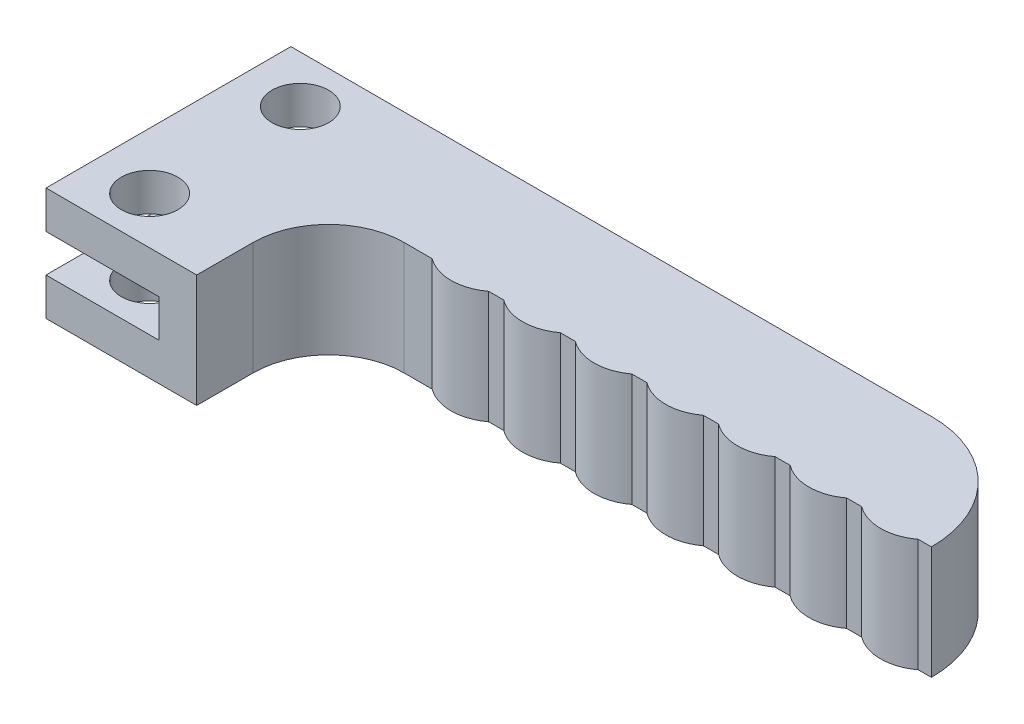
ISO-10303-21;
HEADER;
FILE_DESCRIPTION(('STEP AP214'),'2;1');
FILE_NAME('part.step','',(''),(''),'','','');
FILE_SCHEMA(('AUTOMOTIVE_DESIGN { 1 0 10303 214 1 1 1 1 }'));
ENDSEC;
DATA;
#1=APPLICATION_CONTEXT('core data for automotive mechanical design processes');
#2=APPLICATION_PROTOCOL_DEFINITION('international standard','automotive_design',2000,#1);
#3=PRODUCT_CONTEXT('',#1,'mechanical');
#4=PRODUCT('Part','Part','',(#3));
#5=PRODUCT_RELATED_PRODUCT_CATEGORY('part','',(#4));
#6=PRODUCT_DEFINITION_FORMATION('','',#4);
#7=PRODUCT_DEFINITION_CONTEXT('part definition',#1,'design');
#8=PRODUCT_DEFINITION('design','',#6,#7);
#9=PRODUCT_DEFINITION_SHAPE('','',#8);
#10=(LENGTH_UNIT() NAMED_UNIT(*) SI_UNIT(.MILLI.,.METRE.));
#11=(NAMED_UNIT(*) PLANE_ANGLE_UNIT() SI_UNIT($,.RADIAN.));
#12=(NAMED_UNIT(*) SI_UNIT($,.STERADIAN.) SOLID_ANGLE_UNIT());
#13=UNCERTAINTY_MEASURE_WITH_UNIT(LENGTH_MEASURE(1.E-05),#10,'distance_accuracy_value','');
#14=(GEOMETRIC_REPRESENTATION_CONTEXT(3) GLOBAL_UNCERTAINTY_ASSIGNED_CONTEXT((#13)) GLOBAL_UNIT_ASSIGNED_CONTEXT((#10,
#11,#12)) REPRESENTATION_CONTEXT('',''));
#15=CARTESIAN_POINT('',(0.,0.,0.));
#16=DIRECTION('',(0.,0.,1.));
#17=DIRECTION('',(1.,0.,0.));
#18=AXIS2_PLACEMENT_3D('',#15,#16,#17);
#19=CARTESIAN_POINT('',(-17.,0.,4.));
#20=DIRECTION('',(0.,1.,0.));
#21=DIRECTION('',(0.,0.,1.));
#22=AXIS2_PLACEMENT_3D('',#19,#20,#21);
#23=CYLINDRICAL_SURFACE('',#22,1.5);
#24=CARTESIAN_POINT('',(-17.,2.,4.));
#25=DIRECTION('',(0.,1.,0.));
#26=DIRECTION('',(0.,0.,1.));
#27=AXIS2_PLACEMENT_3D('',#24,#25,#26);
#28=CIRCLE('',#27,1.5);
#29=CARTESIAN_POINT('',(-17.,2.,5.5));
#30=VERTEX_POINT('',#29);
#31=EDGE_CURVE('E11',#30,#30,#28,.T.);
#32=ORIENTED_EDGE('',*,*,#31,.T.);
#33=EDGE_LOOP('',(#32));
#34=FACE_BOUND('',#33,.T.);
#35=CARTESIAN_POINT('',(-17.,0.,4.));
#36=DIRECTION('',(0.,1.,0.));
#37=DIRECTION('',(0.,0.,1.));
#38=AXIS2_PLACEMENT_3D('',#35,#36,#37);
#39=CIRCLE('',#38,1.5);
#40=CARTESIAN_POINT('',(-17.,0.,5.5));
#41=VERTEX_POINT('',#40);
#42=EDGE_CURVE('E326',#41,#41,#39,.T.);
#43=ORIENTED_EDGE('',*,*,#42,.F.);
#44=EDGE_LOOP('',(#43));
#45=FACE_BOUND('',#44,.T.);
#46=ADVANCED_FACE('F17',(#34,#45),#23,.F.);
#47=CARTESIAN_POINT('',(-17.,0.,-4.));
#48=DIRECTION('',(0.,1.,0.));
#49=DIRECTION('',(0.,0.,1.));
#50=AXIS2_PLACEMENT_3D('',#47,#48,#49);
#51=CYLINDRICAL_SURFACE('',#50,1.5);
#52=CARTESIAN_POINT('',(-17.,2.,-4.));
#53=DIRECTION('',(0.,1.,0.));
#54=DIRECTION('',(0.,0.,1.));
#55=AXIS2_PLACEMENT_3D('',#52,#53,#54);
#56=CIRCLE('',#55,1.5);
#57=CARTESIAN_POINT('',(-17.,2.,-2.5));
#58=VERTEX_POINT('',#57);
#59=EDGE_CURVE('E27',#58,#58,#56,.T.);
#60=ORIENTED_EDGE('',*,*,#59,.T.);
#61=EDGE_LOOP('',(#60));
#62=FACE_BOUND('',#61,.T.);
#63=CARTESIAN_POINT('',(-17.,0.,-4.));
#64=DIRECTION('',(0.,1.,0.));
#65=DIRECTION('',(0.,0.,1.));
#66=AXIS2_PLACEMENT_3D('',#63,#64,#65);
#67=CIRCLE('',#66,1.5);
#68=CARTESIAN_POINT('',(-17.,0.,-2.5));
#69=VERTEX_POINT('',#68);
#70=EDGE_CURVE('E257',#69,#69,#67,.T.);
#71=ORIENTED_EDGE('',*,*,#70,.F.);
#72=EDGE_LOOP('',(#71));
#73=FACE_BOUND('',#72,.T.);
#74=ADVANCED_FACE('F438',(#62,#73),#51,.F.);
#75=CARTESIAN_POINT('',(-17.,4.,4.));
#76=DIRECTION('',(0.,1.,0.));
#77=DIRECTION('',(0.,0.,1.));
#78=AXIS2_PLACEMENT_3D('',#75,#76,#77);
#79=CYLINDRICAL_SURFACE('',#78,1.5);
#80=CARTESIAN_POINT('',(-17.,6.,4.));
#81=DIRECTION('',(0.,1.,0.));
#82=DIRECTION('',(0.,0.,1.));
#83=AXIS2_PLACEMENT_3D('',#80,#81,#82);
#84=CIRCLE('',#83,1.5);
#85=CARTESIAN_POINT('',(-17.,6.,5.5));
#86=VERTEX_POINT('',#85);
#87=EDGE_CURVE('E421',#86,#86,#84,.T.);
#88=ORIENTED_EDGE('',*,*,#87,.T.);
#89=EDGE_LOOP('',(#88));
#90=FACE_BOUND('',#89,.T.);
#91=CARTESIAN_POINT('',(-17.,4.,4.));
#92=DIRECTION('',(0.,1.,0.));
#93=DIRECTION('',(0.,0.,1.));
#94=AXIS2_PLACEMENT_3D('',#91,#92,#93);
#95=CIRCLE('',#94,1.5);
#96=CARTESIAN_POINT('',(-17.,4.,5.5));
#97=VERTEX_POINT('',#96);
#98=EDGE_CURVE('E198',#97,#97,#95,.T.);
#99=ORIENTED_EDGE('',*,*,#98,.F.);
#100=EDGE_LOOP('',(#99));
#101=FACE_BOUND('',#100,.T.);
#102=ADVANCED_FACE('F445',(#90,#101),#79,.F.);
#103=CARTESIAN_POINT('',(-17.,4.,-4.));
#104=DIRECTION('',(0.,1.,0.));
#105=DIRECTION('',(0.,0.,1.));
#106=AXIS2_PLACEMENT_3D('',#103,#104,#105);
#107=CYLINDRICAL_SURFACE('',#106,1.5);
#108=CARTESIAN_POINT('',(-17.,6.,-4.));
#109=DIRECTION('',(0.,1.,0.));
#110=DIRECTION('',(0.,0.,1.));
#111=AXIS2_PLACEMENT_3D('',#108,#109,#110);
#112=CIRCLE('',#111,1.5);
#113=CARTESIAN_POINT('',(-17.,6.,-2.5));
#114=VERTEX_POINT('',#113);
#115=EDGE_CURVE('E418',#114,#114,#112,.T.);
#116=ORIENTED_EDGE('',*,*,#115,.T.);
#117=EDGE_LOOP('',(#116));
#118=FACE_BOUND('',#117,.T.);
#119=CARTESIAN_POINT('',(-17.,4.,-4.));
#120=DIRECTION('',(0.,1.,0.));
#121=DIRECTION('',(0.,0.,1.));
#122=AXIS2_PLACEMENT_3D('',#119,#120,#121);
#123=CIRCLE('',#122,1.5);
#124=CARTESIAN_POINT('',(-17.,4.,-2.5));
#125=VERTEX_POINT('',#124);
#126=EDGE_CURVE('E292',#125,#125,#123,.T.);
#127=ORIENTED_EDGE('',*,*,#126,.F.);
#128=EDGE_LOOP('',(#127));
#129=FACE_BOUND('',#128,.T.);
#130=ADVANCED_FACE('F451',(#118,#129),#107,.F.);
#131=CARTESIAN_POINT('',(20.,0.,-0.500000000000003));
#132=DIRECTION('',(0.,0.,-1.));
#133=DIRECTION('',(-1.,0.,0.));
#134=AXIS2_PLACEMENT_3D('',#131,#132,#133);
#135=PLANE('',#134);
#136=DIRECTION('',(-1.,0.,0.));
#137=VECTOR('',#136,1.);
#138=CARTESIAN_POINT('',(20.,6.,-0.500000000000003));
#139=LINE('',#138,#137);
#140=CARTESIAN_POINT('',(20.,6.,-0.500000000000003));
#141=VERTEX_POINT('',#140);
#142=CARTESIAN_POINT('',(19.3,6.,-0.5));
#143=VERTEX_POINT('',#142);
#144=EDGE_CURVE('E416',#141,#143,#139,.T.);
#145=ORIENTED_EDGE('',*,*,#144,.T.);
#146=DIRECTION('',(0.,-1.,0.));
#147=VECTOR('',#146,1.);
#148=CARTESIAN_POINT('',(19.3,6.,-0.5));
#149=LINE('',#148,#147);
#150=CARTESIAN_POINT('',(19.3,0.,-0.5));
#151=VERTEX_POINT('',#150);
#152=EDGE_CURVE('E36',#143,#151,#149,.T.);
#153=ORIENTED_EDGE('',*,*,#152,.T.);
#154=DIRECTION('',(-1.,0.,0.));
#155=VECTOR('',#154,1.);
#156=CARTESIAN_POINT('',(20.,0.,-0.500000000000003));
#157=LINE('',#156,#155);
#158=CARTESIAN_POINT('',(20.,0.,-0.500000000000003));
#159=VERTEX_POINT('',#158);
#160=EDGE_CURVE('E258',#159,#151,#157,.T.);
#161=ORIENTED_EDGE('',*,*,#160,.F.);
#162=DIRECTION('',(0.,1.,0.));
#163=VECTOR('',#162,1.);
#164=CARTESIAN_POINT('',(20.,0.,-0.500000000000003));
#165=LINE('',#164,#163);
#166=EDGE_CURVE('E409',#159,#141,#165,.T.);
#167=ORIENTED_EDGE('',*,*,#166,.T.);
#168=EDGE_LOOP('',(#145,#153,#161,#167));
#169=FACE_BOUND('',#168,.T.);
#170=ADVANCED_FACE('F455',(#169),#135,.F.);
#171=CARTESIAN_POINT('',(20.,0.,-0.500000000000003));
#172=DIRECTION('',(0.,0.,-1.));
#173=DIRECTION('',(-1.,0.,0.));
#174=AXIS2_PLACEMENT_3D('',#171,#172,#173);
#175=PLANE('',#174);
#176=DIRECTION('',(-1.,0.,0.));
#177=VECTOR('',#176,1.);
#178=CARTESIAN_POINT('',(20.,0.,-0.500000000000003));
#179=LINE('',#178,#177);
#180=CARTESIAN_POINT('',(16.3,0.,-0.500000000000003));
#181=VERTEX_POINT('',#180);
#182=CARTESIAN_POINT('',(15.5,0.,-0.5));
#183=VERTEX_POINT('',#182);
#184=EDGE_CURVE('E262',#181,#183,#179,.T.);
#185=ORIENTED_EDGE('',*,*,#184,.F.);
#186=DIRECTION('',(0.,-1.,0.));
#187=VECTOR('',#186,1.);
#188=CARTESIAN_POINT('',(16.3,6.,-0.5));
#189=LINE('',#188,#187);
#190=CARTESIAN_POINT('',(16.3,6.,-0.5));
#191=VERTEX_POINT('',#190);
#192=EDGE_CURVE('E253',#191,#181,#189,.T.);
#193=ORIENTED_EDGE('',*,*,#192,.F.);
#194=DIRECTION('',(-1.,0.,0.));
#195=VECTOR('',#194,1.);
#196=CARTESIAN_POINT('',(20.,6.,-0.500000000000003));
#197=LINE('',#196,#195);
#198=CARTESIAN_POINT('',(15.5,6.,-0.5));
#199=VERTEX_POINT('',#198);
#200=EDGE_CURVE('E406',#191,#199,#197,.T.);
#201=ORIENTED_EDGE('',*,*,#200,.T.);
#202=DIRECTION('',(0.,-1.,0.));
#203=VECTOR('',#202,1.);
#204=CARTESIAN_POINT('',(15.5,6.,-0.5));
#205=LINE('',#204,#203);
#206=EDGE_CURVE('E401',#199,#183,#205,.T.);
#207=ORIENTED_EDGE('',*,*,#206,.T.);
#208=EDGE_LOOP('',(#185,#193,#201,#207));
#209=FACE_BOUND('',#208,.T.);
#210=ADVANCED_FACE('F459',(#209),#175,.F.);
#211=CARTESIAN_POINT('',(20.,0.,-0.500000000000003));
#212=DIRECTION('',(0.,0.,-1.));
#213=DIRECTION('',(-1.,0.,0.));
#214=AXIS2_PLACEMENT_3D('',#211,#212,#213);
#215=PLANE('',#214);
#216=DIRECTION('',(-1.,0.,0.));
#217=VECTOR('',#216,1.);
#218=CARTESIAN_POINT('',(20.,0.,-0.500000000000003));
#219=LINE('',#218,#217);
#220=CARTESIAN_POINT('',(12.5,0.,-0.500000000000002));
#221=VERTEX_POINT('',#220);
#222=CARTESIAN_POINT('',(11.7,0.,-0.5));
#223=VERTEX_POINT('',#222);
#224=EDGE_CURVE('E266',#221,#223,#219,.T.);
#225=ORIENTED_EDGE('',*,*,#224,.F.);
#226=DIRECTION('',(0.,-1.,0.));
#227=VECTOR('',#226,1.);
#228=CARTESIAN_POINT('',(12.5,6.,-0.5));
#229=LINE('',#228,#227);
#230=CARTESIAN_POINT('',(12.5,6.,-0.5));
#231=VERTEX_POINT('',#230);
#232=EDGE_CURVE('E250',#231,#221,#229,.T.);
#233=ORIENTED_EDGE('',*,*,#232,.F.);
#234=DIRECTION('',(-1.,0.,0.));
#235=VECTOR('',#234,1.);
#236=CARTESIAN_POINT('',(20.,6.,-0.500000000000003));
#237=LINE('',#236,#235);
#238=CARTESIAN_POINT('',(11.7,6.,-0.5));
#239=VERTEX_POINT('',#238);
#240=EDGE_CURVE('E398',#231,#239,#237,.T.);
#241=ORIENTED_EDGE('',*,*,#240,.T.);
#242=DIRECTION('',(0.,-1.,0.));
#243=VECTOR('',#242,1.);
#244=CARTESIAN_POINT('',(11.7,6.,-0.5));
#245=LINE('',#244,#243);
#246=EDGE_CURVE('E393',#239,#223,#245,.T.);
#247=ORIENTED_EDGE('',*,*,#246,.T.);
#248=EDGE_LOOP('',(#225,#233,#241,#247));
#249=FACE_BOUND('',#248,.T.);
#250=ADVANCED_FACE('F463',(#249),#215,.F.);
#251=CARTESIAN_POINT('',(20.,0.,-0.500000000000003));
#252=DIRECTION('',(0.,0.,-1.));
#253=DIRECTION('',(-1.,0.,0.));
#254=AXIS2_PLACEMENT_3D('',#251,#252,#253);
#255=PLANE('',#254);
#256=DIRECTION('',(-1.,0.,0.));
#257=VECTOR('',#256,1.);
#258=CARTESIAN_POINT('',(20.,0.,-0.500000000000003));
#259=LINE('',#258,#257);
#260=CARTESIAN_POINT('',(8.69999999999999,0.,-0.500000000000002));
#261=VERTEX_POINT('',#260);
#262=CARTESIAN_POINT('',(7.9,0.,-0.5));
#263=VERTEX_POINT('',#262);
#264=EDGE_CURVE('E270',#261,#263,#259,.T.);
#265=ORIENTED_EDGE('',*,*,#264,.F.);
#266=DIRECTION('',(0.,-1.,0.));
#267=VECTOR('',#266,1.);
#268=CARTESIAN_POINT('',(8.69999999999999,6.,-0.5));
#269=LINE('',#268,#267);
#270=CARTESIAN_POINT('',(8.69999999999999,6.,-0.5));
#271=VERTEX_POINT('',#270);
#272=EDGE_CURVE('E246',#271,#261,#269,.T.);
#273=ORIENTED_EDGE('',*,*,#272,.F.);
#274=DIRECTION('',(-1.,0.,0.));
#275=VECTOR('',#274,1.);
#276=CARTESIAN_POINT('',(20.,6.,-0.500000000000003));
#277=LINE('',#276,#275);
#278=CARTESIAN_POINT('',(7.9,6.,-0.5));
#279=VERTEX_POINT('',#278);
#280=EDGE_CURVE('E390',#271,#279,#277,.T.);
#281=ORIENTED_EDGE('',*,*,#280,.T.);
#282=DIRECTION('',(0.,-1.,0.));
#283=VECTOR('',#282,1.);
#284=CARTESIAN_POINT('',(7.9,6.,-0.5));
#285=LINE('',#284,#283);
#286=EDGE_CURVE('E385',#279,#263,#285,.T.);
#287=ORIENTED_EDGE('',*,*,#286,.T.);
#288=EDGE_LOOP('',(#265,#273,#281,#287));
#289=FACE_BOUND('',#288,.T.);
#290=ADVANCED_FACE('F467',(#289),#255,.F.);
#291=CARTESIAN_POINT('',(20.,0.,-0.500000000000003));
#292=DIRECTION('',(0.,0.,-1.));
#293=DIRECTION('',(-1.,0.,0.));
#294=AXIS2_PLACEMENT_3D('',#291,#292,#293);
#295=PLANE('',#294);
#296=DIRECTION('',(-1.,0.,0.));
#297=VECTOR('',#296,1.);
#298=CARTESIAN_POINT('',(20.,0.,-0.500000000000003));
#299=LINE('',#298,#297);
#300=CARTESIAN_POINT('',(4.9,0.,-0.500000000000001));
#301=VERTEX_POINT('',#300);
#302=CARTESIAN_POINT('',(4.1,0.,-0.5));
#303=VERTEX_POINT('',#302);
#304=EDGE_CURVE('E274',#301,#303,#299,.T.);
#305=ORIENTED_EDGE('',*,*,#304,.F.);
#306=DIRECTION('',(0.,-1.,0.));
#307=VECTOR('',#306,1.);
#308=CARTESIAN_POINT('',(4.9,6.,-0.5));
#309=LINE('',#308,#307);
#310=CARTESIAN_POINT('',(4.9,6.,-0.5));
#311=VERTEX_POINT('',#310);
#312=EDGE_CURVE('E242',#311,#301,#309,.T.);
#313=ORIENTED_EDGE('',*,*,#312,.F.);
#314=DIRECTION('',(-1.,0.,0.));
#315=VECTOR('',#314,1.);
#316=CARTESIAN_POINT('',(20.,6.,-0.500000000000003));
#317=LINE('',#316,#315);
#318=CARTESIAN_POINT('',(4.1,6.,-0.5));
#319=VERTEX_POINT('',#318);
#320=EDGE_CURVE('E382',#311,#319,#317,.T.);
#321=ORIENTED_EDGE('',*,*,#320,.T.);
#322=DIRECTION('',(0.,-1.,0.));
#323=VECTOR('',#322,1.);
#324=CARTESIAN_POINT('',(4.1,6.,-0.5));
#325=LINE('',#324,#323);
#326=EDGE_CURVE('E377',#319,#303,#325,.T.);
#327=ORIENTED_EDGE('',*,*,#326,.T.);
#328=EDGE_LOOP('',(#305,#313,#321,#327));
#329=FACE_BOUND('',#328,.T.);
#330=ADVANCED_FACE('F471',(#329),#295,.F.);
#331=CARTESIAN_POINT('',(20.,0.,-0.500000000000003));
#332=DIRECTION('',(0.,0.,-1.));
#333=DIRECTION('',(-1.,0.,0.));
#334=AXIS2_PLACEMENT_3D('',#331,#332,#333);
#335=PLANE('',#334);
#336=DIRECTION('',(-1.,0.,0.));
#337=VECTOR('',#336,1.);
#338=CARTESIAN_POINT('',(20.,0.,-0.500000000000003));
#339=LINE('',#338,#337);
#340=CARTESIAN_POINT('',(1.09999999999999,0.,-0.500000000000001));
#341=VERTEX_POINT('',#340);
#342=CARTESIAN_POINT('',(0.299999999999997,0.,-0.5));
#343=VERTEX_POINT('',#342);
#344=EDGE_CURVE('E278',#341,#343,#339,.T.);
#345=ORIENTED_EDGE('',*,*,#344,.F.);
#346=DIRECTION('',(0.,-1.,0.));
#347=VECTOR('',#346,1.);
#348=CARTESIAN_POINT('',(1.09999999999999,6.,-0.5));
#349=LINE('',#348,#347);
#350=CARTESIAN_POINT('',(1.09999999999999,6.,-0.5));
#351=VERTEX_POINT('',#350);
#352=EDGE_CURVE('E238',#351,#341,#349,.T.);
#353=ORIENTED_EDGE('',*,*,#352,.F.);
#354=DIRECTION('',(-1.,0.,0.));
#355=VECTOR('',#354,1.);
#356=CARTESIAN_POINT('',(20.,6.,-0.500000000000003));
#357=LINE('',#356,#355);
#358=CARTESIAN_POINT('',(0.299999999999997,6.,-0.5));
#359=VERTEX_POINT('',#358);
#360=EDGE_CURVE('E374',#351,#359,#357,.T.);
#361=ORIENTED_EDGE('',*,*,#360,.T.);
#362=DIRECTION('',(0.,-1.,0.));
#363=VECTOR('',#362,1.);
#364=CARTESIAN_POINT('',(0.299999999999997,6.,-0.5));
#365=LINE('',#364,#363);
#366=EDGE_CURVE('E343',#359,#343,#365,.T.);
#367=ORIENTED_EDGE('',*,*,#366,.T.);
#368=EDGE_LOOP('',(#345,#353,#361,#367));
#369=FACE_BOUND('',#368,.T.);
#370=ADVANCED_FACE('F475',(#369),#335,.F.);
#371=CARTESIAN_POINT('',(20.,0.,-0.500000000000003));
#372=DIRECTION('',(0.,0.,-1.));
#373=DIRECTION('',(-1.,0.,0.));
#374=AXIS2_PLACEMENT_3D('',#371,#372,#373);
#375=PLANE('',#374);
#376=DIRECTION('',(-1.,0.,0.));
#377=VECTOR('',#376,1.);
#378=CARTESIAN_POINT('',(20.,0.,-0.500000000000003));
#379=LINE('',#378,#377);
#380=CARTESIAN_POINT('',(-2.7,0.,-0.5));
#381=VERTEX_POINT('',#380);
#382=CARTESIAN_POINT('',(-3.5,0.,-0.5));
#383=VERTEX_POINT('',#382);
#384=EDGE_CURVE('E282',#381,#383,#379,.T.);
#385=ORIENTED_EDGE('',*,*,#384,.F.);
#386=DIRECTION('',(0.,-1.,0.));
#387=VECTOR('',#386,1.);
#388=CARTESIAN_POINT('',(-2.70000000000001,6.,-0.5));
#389=LINE('',#388,#387);
#390=CARTESIAN_POINT('',(-2.70000000000001,6.,-0.5));
#391=VERTEX_POINT('',#390);
#392=EDGE_CURVE('E228',#391,#381,#389,.T.);
#393=ORIENTED_EDGE('',*,*,#392,.F.);
#394=DIRECTION('',(-1.,0.,0.));
#395=VECTOR('',#394,1.);
#396=CARTESIAN_POINT('',(20.,6.,-0.500000000000003));
#397=LINE('',#396,#395);
#398=CARTESIAN_POINT('',(-3.5,6.,-0.5));
#399=VERTEX_POINT('',#398);
#400=EDGE_CURVE('E337',#391,#399,#397,.T.);
#401=ORIENTED_EDGE('',*,*,#400,.T.);
#402=DIRECTION('',(0.,-1.,0.));
#403=VECTOR('',#402,1.);
#404=CARTESIAN_POINT('',(-3.5,6.,-0.5));
#405=LINE('',#404,#403);
#406=EDGE_CURVE('E333',#399,#383,#405,.T.);
#407=ORIENTED_EDGE('',*,*,#406,.T.);
#408=EDGE_LOOP('',(#385,#393,#401,#407));
#409=FACE_BOUND('',#408,.T.);
#410=ADVANCED_FACE('F341',(#409),#375,.F.);
#411=CARTESIAN_POINT('',(-20.,6.,6.5));
#412=DIRECTION('',(1.,0.,0.));
#413=DIRECTION('',(0.,0.,-1.));
#414=AXIS2_PLACEMENT_3D('',#411,#412,#413);
#415=PLANE('',#414);
#416=DIRECTION('',(0.,-1.,0.));
#417=VECTOR('',#416,1.);
#418=CARTESIAN_POINT('',(-20.,6.,-6.5));
#419=LINE('',#418,#417);
#420=CARTESIAN_POINT('',(-20.,6.,-6.5));
#421=VERTEX_POINT('',#420);
#422=CARTESIAN_POINT('',(-20.,4.,-6.5));
#423=VERTEX_POINT('',#422);
#424=EDGE_CURVE('E338',#421,#423,#419,.T.);
#425=ORIENTED_EDGE('',*,*,#424,.T.);
#426=DIRECTION('',(0.,0.,1.));
#427=VECTOR('',#426,1.);
#428=CARTESIAN_POINT('',(-20.,4.,-6.5));
#429=LINE('',#428,#427);
#430=CARTESIAN_POINT('',(-20.,4.,6.5));
#431=VERTEX_POINT('',#430);
#432=EDGE_CURVE('E363',#423,#431,#429,.T.);
#433=ORIENTED_EDGE('',*,*,#432,.T.);
#434=DIRECTION('',(0.,-1.,0.));
#435=VECTOR('',#434,1.);
#436=CARTESIAN_POINT('',(-20.,6.,6.5));
#437=LINE('',#436,#435);
#438=CARTESIAN_POINT('',(-20.,6.,6.5));
#439=VERTEX_POINT('',#438);
#440=EDGE_CURVE('E353',#439,#431,#437,.T.);
#441=ORIENTED_EDGE('',*,*,#440,.F.);
#442=DIRECTION('',(0.,0.,1.));
#443=VECTOR('',#442,1.);
#444=CARTESIAN_POINT('',(-20.,6.,6.5));
#445=LINE('',#444,#443);
#446=EDGE_CURVE('E306',#421,#439,#445,.T.);
#447=ORIENTED_EDGE('',*,*,#446,.F.);
#448=EDGE_LOOP('',(#425,#433,#441,#447));
#449=FACE_BOUND('',#448,.T.);
#450=ADVANCED_FACE('F482',(#449),#415,.F.);
#451=CARTESIAN_POINT('',(-20.,6.,6.5));
#452=DIRECTION('',(1.,0.,0.));
#453=DIRECTION('',(0.,0.,-1.));
#454=AXIS2_PLACEMENT_3D('',#451,#452,#453);
#455=PLANE('',#454);
#456=DIRECTION('',(0.,-1.,0.));
#457=VECTOR('',#456,1.);
#458=CARTESIAN_POINT('',(-20.,6.,6.5));
#459=LINE('',#458,#457);
#460=CARTESIAN_POINT('',(-20.,2.,6.5));
#461=VERTEX_POINT('',#460);
#462=CARTESIAN_POINT('',(-20.,0.,6.5));
#463=VERTEX_POINT('',#462);
#464=EDGE_CURVE('E310',#461,#463,#459,.T.);
#465=ORIENTED_EDGE('',*,*,#464,.F.);
#466=DIRECTION('',(0.,0.,1.));
#467=VECTOR('',#466,1.);
#468=CARTESIAN_POINT('',(-20.,2.,-6.5));
#469=LINE('',#468,#467);
#470=CARTESIAN_POINT('',(-20.,2.,-6.5));
#471=VERTEX_POINT('',#470);
#472=EDGE_CURVE('E209',#471,#461,#469,.T.);
#473=ORIENTED_EDGE('',*,*,#472,.F.);
#474=DIRECTION('',(0.,-1.,0.));
#475=VECTOR('',#474,1.);
#476=CARTESIAN_POINT('',(-20.,6.,-6.5));
#477=LINE('',#476,#475);
#478=CARTESIAN_POINT('',(-20.,0.,-6.5));
#479=VERTEX_POINT('',#478);
#480=EDGE_CURVE('E361',#471,#479,#477,.T.);
#481=ORIENTED_EDGE('',*,*,#480,.T.);
#482=DIRECTION('',(0.,0.,1.));
#483=VECTOR('',#482,1.);
#484=CARTESIAN_POINT('',(-20.,0.,6.5));
#485=LINE('',#484,#483);
#486=EDGE_CURVE('E355',#479,#463,#485,.T.);
#487=ORIENTED_EDGE('',*,*,#486,.T.);
#488=EDGE_LOOP('',(#465,#473,#481,#487));
#489=FACE_BOUND('',#488,.T.);
#490=ADVANCED_FACE('F485',(#489),#455,.F.);
#491=CARTESIAN_POINT('',(20.,6.,6.5));
#492=DIRECTION('',(0.,0.,-1.));
#493=DIRECTION('',(-1.,0.,0.));
#494=AXIS2_PLACEMENT_3D('',#491,#492,#493);
#495=PLANE('',#494);
#496=DIRECTION('',(1.,0.,0.));
#497=VECTOR('',#496,1.);
#498=CARTESIAN_POINT('',(20.,0.,6.5));
#499=LINE('',#498,#497);
#500=CARTESIAN_POINT('',(-12.,0.,6.5));
#501=VERTEX_POINT('',#500);
#502=EDGE_CURVE('E352',#463,#501,#499,.T.);
#503=ORIENTED_EDGE('',*,*,#502,.T.);
#504=DIRECTION('',(0.,1.,0.));
#505=VECTOR('',#504,1.);
#506=CARTESIAN_POINT('',(-12.,0.,6.5));
#507=LINE('',#506,#505);
#508=CARTESIAN_POINT('',(-12.,6.,6.5));
#509=VERTEX_POINT('',#508);
#510=EDGE_CURVE('E194',#501,#509,#507,.T.);
#511=ORIENTED_EDGE('',*,*,#510,.T.);
#512=DIRECTION('',(1.,0.,0.));
#513=VECTOR('',#512,1.);
#514=CARTESIAN_POINT('',(20.,6.,6.5));
#515=LINE('',#514,#513);
#516=EDGE_CURVE('E325',#439,#509,#515,.T.);
#517=ORIENTED_EDGE('',*,*,#516,.F.);
#518=ORIENTED_EDGE('',*,*,#440,.T.);
#519=DIRECTION('',(-1.,0.,0.));
#520=VECTOR('',#519,1.);
#521=CARTESIAN_POINT('',(-20.,4.,6.5));
#522=LINE('',#521,#520);
#523=CARTESIAN_POINT('',(-14.,4.,6.5));
#524=VERTEX_POINT('',#523);
#525=EDGE_CURVE('E287',#524,#431,#522,.T.);
#526=ORIENTED_EDGE('',*,*,#525,.F.);
#527=DIRECTION('',(0.,1.,0.));
#528=VECTOR('',#527,1.);
#529=CARTESIAN_POINT('',(-14.,4.,6.5));
#530=LINE('',#529,#528);
#531=CARTESIAN_POINT('',(-14.,2.,6.5));
#532=VERTEX_POINT('',#531);
#533=EDGE_CURVE('E288',#532,#524,#530,.T.);
#534=ORIENTED_EDGE('',*,*,#533,.F.);
#535=DIRECTION('',(1.,0.,0.));
#536=VECTOR('',#535,1.);
#537=CARTESIAN_POINT('',(-20.,2.,6.5));
#538=LINE('',#537,#536);
#539=EDGE_CURVE('E212',#461,#532,#538,.T.);
#540=ORIENTED_EDGE('',*,*,#539,.F.);
#541=ORIENTED_EDGE('',*,*,#464,.T.);
#542=EDGE_LOOP('',(#503,#511,#517,#518,#526,#534,#540,#541));
#543=FACE_BOUND('',#542,.T.);
#544=ADVANCED_FACE('F351',(#543),#495,.F.);
#545=CARTESIAN_POINT('',(20.,6.,-6.5));
#546=DIRECTION('',(0.,0.,1.));
#547=DIRECTION('',(1.,0.,0.));
#548=AXIS2_PLACEMENT_3D('',#545,#546,#547);
#549=PLANE('',#548);
#550=DIRECTION('',(-1.,0.,0.));
#551=VECTOR('',#550,1.);
#552=CARTESIAN_POINT('',(20.,6.,-6.5));
#553=LINE('',#552,#551);
#554=CARTESIAN_POINT('',(14.,6.,-6.5));
#555=VERTEX_POINT('',#554);
#556=EDGE_CURVE('E302',#555,#421,#553,.T.);
#557=ORIENTED_EDGE('',*,*,#556,.F.);
#558=DIRECTION('',(0.,-1.,0.));
#559=VECTOR('',#558,1.);
#560=CARTESIAN_POINT('',(14.,6.,-6.5));
#561=LINE('',#560,#559);
#562=CARTESIAN_POINT('',(14.,0.,-6.5));
#563=VERTEX_POINT('',#562);
#564=EDGE_CURVE('E307',#555,#563,#561,.T.);
#565=ORIENTED_EDGE('',*,*,#564,.T.);
#566=DIRECTION('',(-1.,0.,0.));
#567=VECTOR('',#566,1.);
#568=CARTESIAN_POINT('',(20.,0.,-6.5));
#569=LINE('',#568,#567);
#570=EDGE_CURVE('E311',#563,#479,#569,.T.);
#571=ORIENTED_EDGE('',*,*,#570,.T.);
#572=ORIENTED_EDGE('',*,*,#480,.F.);
#573=DIRECTION('',(1.,0.,0.));
#574=VECTOR('',#573,1.);
#575=CARTESIAN_POINT('',(-20.,2.,-6.5));
#576=LINE('',#575,#574);
#577=CARTESIAN_POINT('',(-14.,2.,-6.5));
#578=VERTEX_POINT('',#577);
#579=EDGE_CURVE('E314',#471,#578,#576,.T.);
#580=ORIENTED_EDGE('',*,*,#579,.T.);
#581=DIRECTION('',(0.,1.,0.));
#582=VECTOR('',#581,1.);
#583=CARTESIAN_POINT('',(-14.,4.,-6.5));
#584=LINE('',#583,#582);
#585=CARTESIAN_POINT('',(-14.,4.,-6.5));
#586=VERTEX_POINT('',#585);
#587=EDGE_CURVE('E317',#578,#586,#584,.T.);
#588=ORIENTED_EDGE('',*,*,#587,.T.);
#589=DIRECTION('',(-1.,0.,0.));
#590=VECTOR('',#589,1.);
#591=CARTESIAN_POINT('',(-20.,4.,-6.5));
#592=LINE('',#591,#590);
#593=EDGE_CURVE('E320',#586,#423,#592,.T.);
#594=ORIENTED_EDGE('',*,*,#593,.T.);
#595=ORIENTED_EDGE('',*,*,#424,.F.);
#596=EDGE_LOOP('',(#557,#565,#571,#572,#580,#588,#594,#595));
#597=FACE_BOUND('',#596,.T.);
#598=ADVANCED_FACE('F492',(#597),#549,.F.);
#599=CARTESIAN_POINT('',(0.,6.,0.));
#600=DIRECTION('',(0.,1.,0.));
#601=DIRECTION('',(0.,0.,1.));
#602=AXIS2_PLACEMENT_3D('',#599,#600,#601);
#603=PLANE('',#602);
#604=ORIENTED_EDGE('',*,*,#144,.F.);
#605=CARTESIAN_POINT('',(14.,6.,-0.500000000000001));
#606=DIRECTION('',(0.,1.,0.));
#607=DIRECTION('',(0.,0.,1.));
#608=AXIS2_PLACEMENT_3D('',#605,#606,#607);
#609=CIRCLE('',#608,6.);
#610=EDGE_CURVE('E305',#141,#555,#609,.T.);
#611=ORIENTED_EDGE('',*,*,#610,.T.);
#612=ORIENTED_EDGE('',*,*,#556,.T.);
#613=ORIENTED_EDGE('',*,*,#446,.T.);
#614=ORIENTED_EDGE('',*,*,#516,.T.);
#615=DIRECTION('',(0.,0.,1.));
#616=VECTOR('',#615,1.);
#617=CARTESIAN_POINT('',(-12.,6.,6.5));
#618=LINE('',#617,#616);
#619=CARTESIAN_POINT('',(-12.,6.,3.5));
#620=VERTEX_POINT('',#619);
#621=EDGE_CURVE('E210',#620,#509,#618,.T.);
#622=ORIENTED_EDGE('',*,*,#621,.F.);
#623=CARTESIAN_POINT('',(-8.,6.,3.5));
#624=DIRECTION('',(0.,-1.,0.));
#625=DIRECTION('',(0.,0.,1.));
#626=AXIS2_PLACEMENT_3D('',#623,#624,#625);
#627=CIRCLE('',#626,4.);
#628=CARTESIAN_POINT('',(-8.,6.,-0.5));
#629=VERTEX_POINT('',#628);
#630=EDGE_CURVE('E208',#620,#629,#627,.T.);
#631=ORIENTED_EDGE('',*,*,#630,.T.);
#632=DIRECTION('',(-1.,0.,0.));
#633=VECTOR('',#632,1.);
#634=CARTESIAN_POINT('',(20.,6.,-0.500000000000003));
#635=LINE('',#634,#633);
#636=CARTESIAN_POINT('',(-6.50000000000001,6.,-0.5));
#637=VERTEX_POINT('',#636);
#638=EDGE_CURVE('E214',#637,#629,#635,.T.);
#639=ORIENTED_EDGE('',*,*,#638,.F.);
#640=CARTESIAN_POINT('',(-5.,6.,-2.5));
#641=DIRECTION('',(0.,-1.,0.));
#642=DIRECTION('',(0.,0.,-1.));
#643=AXIS2_PLACEMENT_3D('',#640,#641,#642);
#644=CIRCLE('',#643,2.5);
#645=EDGE_CURVE('E221',#399,#637,#644,.T.);
#646=ORIENTED_EDGE('',*,*,#645,.F.);
#647=ORIENTED_EDGE('',*,*,#400,.F.);
#648=CARTESIAN_POINT('',(-1.2,6.,-2.5));
#649=DIRECTION('',(0.,-1.,0.));
#650=DIRECTION('',(0.,0.,-1.));
#651=AXIS2_PLACEMENT_3D('',#648,#649,#650);
#652=CIRCLE('',#651,2.5);
#653=EDGE_CURVE('E222',#359,#391,#652,.T.);
#654=ORIENTED_EDGE('',*,*,#653,.F.);
#655=ORIENTED_EDGE('',*,*,#360,.F.);
#656=CARTESIAN_POINT('',(2.6,6.,-2.5));
#657=DIRECTION('',(0.,-1.,0.));
#658=DIRECTION('',(0.,0.,-1.));
#659=AXIS2_PLACEMENT_3D('',#656,#657,#658);
#660=CIRCLE('',#659,2.5);
#661=EDGE_CURVE('E232',#319,#351,#660,.T.);
#662=ORIENTED_EDGE('',*,*,#661,.F.);
#663=ORIENTED_EDGE('',*,*,#320,.F.);
#664=CARTESIAN_POINT('',(6.4,6.,-2.5));
#665=DIRECTION('',(0.,-1.,0.));
#666=DIRECTION('',(0.,0.,-1.));
#667=AXIS2_PLACEMENT_3D('',#664,#665,#666);
#668=CIRCLE('',#667,2.5);
#669=EDGE_CURVE('E239',#279,#311,#668,.T.);
#670=ORIENTED_EDGE('',*,*,#669,.F.);
#671=ORIENTED_EDGE('',*,*,#280,.F.);
#672=CARTESIAN_POINT('',(10.2,6.,-2.5));
#673=DIRECTION('',(0.,-1.,0.));
#674=DIRECTION('',(0.,0.,-1.));
#675=AXIS2_PLACEMENT_3D('',#672,#673,#674);
#676=CIRCLE('',#675,2.5);
#677=EDGE_CURVE('E243',#239,#271,#676,.T.);
#678=ORIENTED_EDGE('',*,*,#677,.F.);
#679=ORIENTED_EDGE('',*,*,#240,.F.);
#680=CARTESIAN_POINT('',(14.,6.,-2.5));
#681=DIRECTION('',(0.,-1.,0.));
#682=DIRECTION('',(0.,0.,-1.));
#683=AXIS2_PLACEMENT_3D('',#680,#681,#682);
#684=CIRCLE('',#683,2.5);
#685=EDGE_CURVE('E247',#199,#231,#684,.T.);
#686=ORIENTED_EDGE('',*,*,#685,.F.);
#687=ORIENTED_EDGE('',*,*,#200,.F.);
#688=CARTESIAN_POINT('',(17.8,6.,-2.5));
#689=DIRECTION('',(0.,-1.,0.));
#690=DIRECTION('',(0.,0.,-1.));
#691=AXIS2_PLACEMENT_3D('',#688,#689,#690);
#692=CIRCLE('',#691,2.5);
#693=EDGE_CURVE('E251',#143,#191,#692,.T.);
#694=ORIENTED_EDGE('',*,*,#693,.F.);
#695=EDGE_LOOP('',(#604,#611,#612,#613,#614,#622,#631,#639,#646,#647,#654,#655,#662,#663,#670,
#671,#678,#679,#686,#687,#694));
#696=FACE_BOUND('',#695,.T.);
#697=ORIENTED_EDGE('',*,*,#87,.F.);
#698=EDGE_LOOP('',(#697));
#699=FACE_BOUND('',#698,.T.);
#700=ORIENTED_EDGE('',*,*,#115,.F.);
#701=EDGE_LOOP('',(#700));
#702=FACE_BOUND('',#701,.T.);
#703=ADVANCED_FACE('F346',(#696,#699,#702),#603,.T.);
#704=CARTESIAN_POINT('',(0.,0.,0.));
#705=DIRECTION('',(0.,1.,0.));
#706=DIRECTION('',(0.,0.,1.));
#707=AXIS2_PLACEMENT_3D('',#704,#705,#706);
#708=PLANE('',#707);
#709=ORIENTED_EDGE('',*,*,#42,.T.);
#710=EDGE_LOOP('',(#709));
#711=FACE_BOUND('',#710,.T.);
#712=ORIENTED_EDGE('',*,*,#70,.T.);
#713=EDGE_LOOP('',(#712));
#714=FACE_BOUND('',#713,.T.);
#715=ORIENTED_EDGE('',*,*,#570,.F.);
#716=CARTESIAN_POINT('',(14.,0.,-0.500000000000001));
#717=DIRECTION('',(0.,-1.,0.));
#718=DIRECTION('',(0.,0.,1.));
#719=AXIS2_PLACEMENT_3D('',#716,#717,#718);
#720=CIRCLE('',#719,6.);
#721=EDGE_CURVE('E254',#563,#159,#720,.T.);
#722=ORIENTED_EDGE('',*,*,#721,.T.);
#723=ORIENTED_EDGE('',*,*,#160,.T.);
#724=CARTESIAN_POINT('',(17.8,0.,-2.5));
#725=DIRECTION('',(0.,-1.,0.));
#726=DIRECTION('',(0.,0.,-1.));
#727=AXIS2_PLACEMENT_3D('',#724,#725,#726);
#728=CIRCLE('',#727,2.5);
#729=EDGE_CURVE('E259',#151,#181,#728,.T.);
#730=ORIENTED_EDGE('',*,*,#729,.T.);
#731=ORIENTED_EDGE('',*,*,#184,.T.);
#732=CARTESIAN_POINT('',(14.,0.,-2.5));
#733=DIRECTION('',(0.,-1.,0.));
#734=DIRECTION('',(0.,0.,-1.));
#735=AXIS2_PLACEMENT_3D('',#732,#733,#734);
#736=CIRCLE('',#735,2.5);
#737=EDGE_CURVE('E263',#183,#221,#736,.T.);
#738=ORIENTED_EDGE('',*,*,#737,.T.);
#739=ORIENTED_EDGE('',*,*,#224,.T.);
#740=CARTESIAN_POINT('',(10.2,0.,-2.5));
#741=DIRECTION('',(0.,-1.,0.));
#742=DIRECTION('',(0.,0.,-1.));
#743=AXIS2_PLACEMENT_3D('',#740,#741,#742);
#744=CIRCLE('',#743,2.5);
#745=EDGE_CURVE('E267',#223,#261,#744,.T.);
#746=ORIENTED_EDGE('',*,*,#745,.T.);
#747=ORIENTED_EDGE('',*,*,#264,.T.);
#748=CARTESIAN_POINT('',(6.4,0.,-2.5));
#749=DIRECTION('',(0.,-1.,0.));
#750=DIRECTION('',(0.,0.,-1.));
#751=AXIS2_PLACEMENT_3D('',#748,#749,#750);
#752=CIRCLE('',#751,2.5);
#753=EDGE_CURVE('E271',#263,#301,#752,.T.);
#754=ORIENTED_EDGE('',*,*,#753,.T.);
#755=ORIENTED_EDGE('',*,*,#304,.T.);
#756=CARTESIAN_POINT('',(2.6,0.,-2.5));
#757=DIRECTION('',(0.,-1.,0.));
#758=DIRECTION('',(0.,0.,-1.));
#759=AXIS2_PLACEMENT_3D('',#756,#757,#758);
#760=CIRCLE('',#759,2.5);
#761=EDGE_CURVE('E275',#303,#341,#760,.T.);
#762=ORIENTED_EDGE('',*,*,#761,.T.);
#763=ORIENTED_EDGE('',*,*,#344,.T.);
#764=CARTESIAN_POINT('',(-1.2,0.,-2.5));
#765=DIRECTION('',(0.,-1.,0.));
#766=DIRECTION('',(0.,0.,-1.));
#767=AXIS2_PLACEMENT_3D('',#764,#765,#766);
#768=CIRCLE('',#767,2.5);
#769=EDGE_CURVE('E279',#343,#381,#768,.T.);
#770=ORIENTED_EDGE('',*,*,#769,.T.);
#771=ORIENTED_EDGE('',*,*,#384,.T.);
#772=CARTESIAN_POINT('',(-5.,0.,-2.5));
#773=DIRECTION('',(0.,-1.,0.));
#774=DIRECTION('',(0.,0.,-1.));
#775=AXIS2_PLACEMENT_3D('',#772,#773,#774);
#776=CIRCLE('',#775,2.5);
#777=CARTESIAN_POINT('',(-6.50000000000001,0.,-0.5));
#778=VERTEX_POINT('',#777);
#779=EDGE_CURVE('E283',#383,#778,#776,.T.);
#780=ORIENTED_EDGE('',*,*,#779,.T.);
#781=DIRECTION('',(-1.,0.,0.));
#782=VECTOR('',#781,1.);
#783=CARTESIAN_POINT('',(20.,0.,-0.500000000000003));
#784=LINE('',#783,#782);
#785=CARTESIAN_POINT('',(-8.,0.,-0.5));
#786=VERTEX_POINT('',#785);
#787=EDGE_CURVE('E202',#778,#786,#784,.T.);
#788=ORIENTED_EDGE('',*,*,#787,.T.);
#789=CARTESIAN_POINT('',(-8.,0.,3.5));
#790=DIRECTION('',(0.,1.,0.));
#791=DIRECTION('',(0.,0.,1.));
#792=AXIS2_PLACEMENT_3D('',#789,#790,#791);
#793=CIRCLE('',#792,4.);
#794=CARTESIAN_POINT('',(-12.,0.,3.5));
#795=VERTEX_POINT('',#794);
#796=EDGE_CURVE('E183',#786,#795,#793,.T.);
#797=ORIENTED_EDGE('',*,*,#796,.T.);
#798=DIRECTION('',(0.,0.,1.));
#799=VECTOR('',#798,1.);
#800=CARTESIAN_POINT('',(-12.,0.,6.5));
#801=LINE('',#800,#799);
#802=EDGE_CURVE('E189',#795,#501,#801,.T.);
#803=ORIENTED_EDGE('',*,*,#802,.T.);
#804=ORIENTED_EDGE('',*,*,#502,.F.);
#805=ORIENTED_EDGE('',*,*,#486,.F.);
#806=EDGE_LOOP('',(#715,#722,#723,#730,#731,#738,#739,#746,#747,#754,#755,#762,#763,#770,#771,
#780,#788,#797,#803,#804,#805));
#807=FACE_BOUND('',#806,.T.);
#808=ADVANCED_FACE('F200',(#711,#714,#807),#708,.F.);
#809=CARTESIAN_POINT('',(-20.,4.,-6.5));
#810=DIRECTION('',(0.,1.,0.));
#811=DIRECTION('',(-1.,0.,0.));
#812=AXIS2_PLACEMENT_3D('',#809,#810,#811);
#813=PLANE('',#812);
#814=ORIENTED_EDGE('',*,*,#98,.T.);
#815=EDGE_LOOP('',(#814));
#816=FACE_BOUND('',#815,.T.);
#817=ORIENTED_EDGE('',*,*,#126,.T.);
#818=EDGE_LOOP('',(#817));
#819=FACE_BOUND('',#818,.T.);
#820=ORIENTED_EDGE('',*,*,#525,.T.);
#821=ORIENTED_EDGE('',*,*,#432,.F.);
#822=ORIENTED_EDGE('',*,*,#593,.F.);
#823=DIRECTION('',(0.,0.,1.));
#824=VECTOR('',#823,1.);
#825=CARTESIAN_POINT('',(-14.,4.,-6.5));
#826=LINE('',#825,#824);
#827=EDGE_CURVE('E285',#586,#524,#826,.T.);
#828=ORIENTED_EDGE('',*,*,#827,.T.);
#829=EDGE_LOOP('',(#820,#821,#822,#828));
#830=FACE_BOUND('',#829,.T.);
#831=ADVANCED_FACE('F500',(#816,#819,#830),#813,.F.);
#832=CARTESIAN_POINT('',(-14.,4.,-6.5));
#833=DIRECTION('',(1.,0.,0.));
#834=DIRECTION('',(0.,0.,-1.));
#835=AXIS2_PLACEMENT_3D('',#832,#833,#834);
#836=PLANE('',#835);
#837=ORIENTED_EDGE('',*,*,#533,.T.);
#838=ORIENTED_EDGE('',*,*,#827,.F.);
#839=ORIENTED_EDGE('',*,*,#587,.F.);
#840=DIRECTION('',(0.,0.,1.));
#841=VECTOR('',#840,1.);
#842=CARTESIAN_POINT('',(-14.,2.,-6.5));
#843=LINE('',#842,#841);
#844=EDGE_CURVE('E217',#578,#532,#843,.T.);
#845=ORIENTED_EDGE('',*,*,#844,.T.);
#846=EDGE_LOOP('',(#837,#838,#839,#845));
#847=FACE_BOUND('',#846,.T.);
#848=ADVANCED_FACE('F503',(#847),#836,.F.);
#849=CARTESIAN_POINT('',(-20.,2.,-6.5));
#850=DIRECTION('',(0.,-1.,0.));
#851=DIRECTION('',(0.,0.,-1.));
#852=AXIS2_PLACEMENT_3D('',#849,#850,#851);
#853=PLANE('',#852);
#854=ORIENTED_EDGE('',*,*,#31,.F.);
#855=EDGE_LOOP('',(#854));
#856=FACE_BOUND('',#855,.T.);
#857=ORIENTED_EDGE('',*,*,#59,.F.);
#858=EDGE_LOOP('',(#857));
#859=FACE_BOUND('',#858,.T.);
#860=ORIENTED_EDGE('',*,*,#539,.T.);
#861=ORIENTED_EDGE('',*,*,#844,.F.);
#862=ORIENTED_EDGE('',*,*,#579,.F.);
#863=ORIENTED_EDGE('',*,*,#472,.T.);
#864=EDGE_LOOP('',(#860,#861,#862,#863));
#865=FACE_BOUND('',#864,.T.);
#866=ADVANCED_FACE('F507',(#856,#859,#865),#853,.F.);
#867=CARTESIAN_POINT('',(-12.,0.,6.5));
#868=DIRECTION('',(-1.,0.,0.));
#869=DIRECTION('',(0.,0.,1.));
#870=AXIS2_PLACEMENT_3D('',#867,#868,#869);
#871=PLANE('',#870);
#872=ORIENTED_EDGE('',*,*,#802,.F.);
#873=DIRECTION('',(0.,1.,0.));
#874=VECTOR('',#873,1.);
#875=CARTESIAN_POINT('',(-12.,6.,3.5));
#876=LINE('',#875,#874);
#877=EDGE_CURVE('E192',#795,#620,#876,.T.);
#878=ORIENTED_EDGE('',*,*,#877,.T.);
#879=ORIENTED_EDGE('',*,*,#621,.T.);
#880=ORIENTED_EDGE('',*,*,#510,.F.);
#881=EDGE_LOOP('',(#872,#878,#879,#880));
#882=FACE_BOUND('',#881,.T.);
#883=ADVANCED_FACE('F190',(#882),#871,.F.);
#884=CARTESIAN_POINT('',(20.,0.,-0.500000000000003));
#885=DIRECTION('',(0.,0.,-1.));
#886=DIRECTION('',(-1.,0.,0.));
#887=AXIS2_PLACEMENT_3D('',#884,#885,#886);
#888=PLANE('',#887);
#889=ORIENTED_EDGE('',*,*,#787,.F.);
#890=DIRECTION('',(0.,-1.,0.));
#891=VECTOR('',#890,1.);
#892=CARTESIAN_POINT('',(-6.50000000000001,6.,-0.5));
#893=LINE('',#892,#891);
#894=EDGE_CURVE('E219',#637,#778,#893,.T.);
#895=ORIENTED_EDGE('',*,*,#894,.F.);
#896=ORIENTED_EDGE('',*,*,#638,.T.);
#897=DIRECTION('',(0.,-1.,0.));
#898=VECTOR('',#897,1.);
#899=CARTESIAN_POINT('',(-8.,0.,-0.5));
#900=LINE('',#899,#898);
#901=EDGE_CURVE('E21',#629,#786,#900,.T.);
#902=ORIENTED_EDGE('',*,*,#901,.T.);
#903=EDGE_LOOP('',(#889,#895,#896,#902));
#904=FACE_BOUND('',#903,.T.);
#905=ADVANCED_FACE('F329',(#904),#888,.F.);
#906=CARTESIAN_POINT('',(-8.,0.,3.5));
#907=DIRECTION('',(0.,-1.,0.));
#908=DIRECTION('',(0.,0.,-1.));
#909=AXIS2_PLACEMENT_3D('',#906,#907,#908);
#910=CYLINDRICAL_SURFACE('',#909,4.);
#911=ORIENTED_EDGE('',*,*,#796,.F.);
#912=ORIENTED_EDGE('',*,*,#901,.F.);
#913=ORIENTED_EDGE('',*,*,#630,.F.);
#914=ORIENTED_EDGE('',*,*,#877,.F.);
#915=EDGE_LOOP('',(#911,#912,#913,#914));
#916=FACE_BOUND('',#915,.T.);
#917=ADVANCED_FACE('F206',(#916),#910,.F.);
#918=CARTESIAN_POINT('',(14.,6.,-0.500000000000001));
#919=DIRECTION('',(0.,-1.,0.));
#920=DIRECTION('',(0.,0.,-1.));
#921=AXIS2_PLACEMENT_3D('',#918,#919,#920);
#922=CYLINDRICAL_SURFACE('',#921,6.);
#923=ORIENTED_EDGE('',*,*,#610,.F.);
#924=ORIENTED_EDGE('',*,*,#166,.F.);
#925=ORIENTED_EDGE('',*,*,#721,.F.);
#926=ORIENTED_EDGE('',*,*,#564,.F.);
#927=EDGE_LOOP('',(#923,#924,#925,#926));
#928=FACE_BOUND('',#927,.T.);
#929=ADVANCED_FACE('F517',(#928),#922,.T.);
#930=CARTESIAN_POINT('',(-5.,6.,-2.5));
#931=DIRECTION('',(0.,-1.,0.));
#932=DIRECTION('',(0.,0.,-1.));
#933=AXIS2_PLACEMENT_3D('',#930,#931,#932);
#934=CYLINDRICAL_SURFACE('',#933,2.5);
#935=ORIENTED_EDGE('',*,*,#779,.F.);
#936=ORIENTED_EDGE('',*,*,#406,.F.);
#937=ORIENTED_EDGE('',*,*,#645,.T.);
#938=ORIENTED_EDGE('',*,*,#894,.T.);
#939=EDGE_LOOP('',(#935,#936,#937,#938));
#940=FACE_BOUND('',#939,.T.);
#941=ADVANCED_FACE('F332',(#940),#934,.T.);
#942=CARTESIAN_POINT('',(-1.2,6.,-2.5));
#943=DIRECTION('',(0.,-1.,0.));
#944=DIRECTION('',(0.,0.,-1.));
#945=AXIS2_PLACEMENT_3D('',#942,#943,#944);
#946=CYLINDRICAL_SURFACE('',#945,2.5);
#947=ORIENTED_EDGE('',*,*,#769,.F.);
#948=ORIENTED_EDGE('',*,*,#366,.F.);
#949=ORIENTED_EDGE('',*,*,#653,.T.);
#950=ORIENTED_EDGE('',*,*,#392,.T.);
#951=EDGE_LOOP('',(#947,#948,#949,#950));
#952=FACE_BOUND('',#951,.T.);
#953=ADVANCED_FACE('F523',(#952),#946,.T.);
#954=CARTESIAN_POINT('',(2.6,6.,-2.5));
#955=DIRECTION('',(0.,-1.,0.));
#956=DIRECTION('',(0.,0.,-1.));
#957=AXIS2_PLACEMENT_3D('',#954,#955,#956);
#958=CYLINDRICAL_SURFACE('',#957,2.5);
#959=ORIENTED_EDGE('',*,*,#761,.F.);
#960=ORIENTED_EDGE('',*,*,#326,.F.);
#961=ORIENTED_EDGE('',*,*,#661,.T.);
#962=ORIENTED_EDGE('',*,*,#352,.T.);
#963=EDGE_LOOP('',(#959,#960,#961,#962));
#964=FACE_BOUND('',#963,.T.);
#965=ADVANCED_FACE('F526',(#964),#958,.T.);
#966=CARTESIAN_POINT('',(6.4,6.,-2.5));
#967=DIRECTION('',(0.,-1.,0.));
#968=DIRECTION('',(0.,0.,-1.));
#969=AXIS2_PLACEMENT_3D('',#966,#967,#968);
#970=CYLINDRICAL_SURFACE('',#969,2.5);
#971=ORIENTED_EDGE('',*,*,#753,.F.);
#972=ORIENTED_EDGE('',*,*,#286,.F.);
#973=ORIENTED_EDGE('',*,*,#669,.T.);
#974=ORIENTED_EDGE('',*,*,#312,.T.);
#975=EDGE_LOOP('',(#971,#972,#973,#974));
#976=FACE_BOUND('',#975,.T.);
#977=ADVANCED_FACE('F529',(#976),#970,.T.);
#978=CARTESIAN_POINT('',(10.2,6.,-2.5));
#979=DIRECTION('',(0.,-1.,0.));
#980=DIRECTION('',(0.,0.,-1.));
#981=AXIS2_PLACEMENT_3D('',#978,#979,#980);
#982=CYLINDRICAL_SURFACE('',#981,2.5);
#983=ORIENTED_EDGE('',*,*,#745,.F.);
#984=ORIENTED_EDGE('',*,*,#246,.F.);
#985=ORIENTED_EDGE('',*,*,#677,.T.);
#986=ORIENTED_EDGE('',*,*,#272,.T.);
#987=EDGE_LOOP('',(#983,#984,#985,#986));
#988=FACE_BOUND('',#987,.T.);
#989=ADVANCED_FACE('F533',(#988),#982,.T.);
#990=CARTESIAN_POINT('',(14.,6.,-2.5));
#991=DIRECTION('',(0.,-1.,0.));
#992=DIRECTION('',(0.,0.,-1.));
#993=AXIS2_PLACEMENT_3D('',#990,#991,#992);
#994=CYLINDRICAL_SURFACE('',#993,2.5);
#995=ORIENTED_EDGE('',*,*,#737,.F.);
#996=ORIENTED_EDGE('',*,*,#206,.F.);
#997=ORIENTED_EDGE('',*,*,#685,.T.);
#998=ORIENTED_EDGE('',*,*,#232,.T.);
#999=EDGE_LOOP('',(#995,#996,#997,#998));
#1000=FACE_BOUND('',#999,.T.);
#1001=ADVANCED_FACE('F536',(#1000),#994,.T.);
#1002=CARTESIAN_POINT('',(17.8,6.,-2.5));
#1003=DIRECTION('',(0.,-1.,0.));
#1004=DIRECTION('',(0.,0.,-1.));
#1005=AXIS2_PLACEMENT_3D('',#1002,#1003,#1004);
#1006=CYLINDRICAL_SURFACE('',#1005,2.5);
#1007=ORIENTED_EDGE('',*,*,#729,.F.);
#1008=ORIENTED_EDGE('',*,*,#152,.F.);
#1009=ORIENTED_EDGE('',*,*,#693,.T.);
#1010=ORIENTED_EDGE('',*,*,#192,.T.);
#1011=EDGE_LOOP('',(#1007,#1008,#1009,#1010));
#1012=FACE_BOUND('',#1011,.T.);
#1013=ADVANCED_FACE('F19',(#1012),#1006,.T.);
#1014=CLOSED_SHELL('',(#46,#74,#102,#130,#170,#210,#250,#290,#330,#370,#410,#450,#490,#544,#598,
#703,#808,#831,#848,#866,#883,#905,#917,#929,#941,#953,#965,#977,#989,#1001,#1013));
#1015=MANIFOLD_SOLID_BREP('B1',#1014);
#1016=ADVANCED_BREP_SHAPE_REPRESENTATION('',(#18,#1015),#14);
#1017=SHAPE_DEFINITION_REPRESENTATION(#9,#1016);
ENDSEC;
END-ISO-10303-21;
